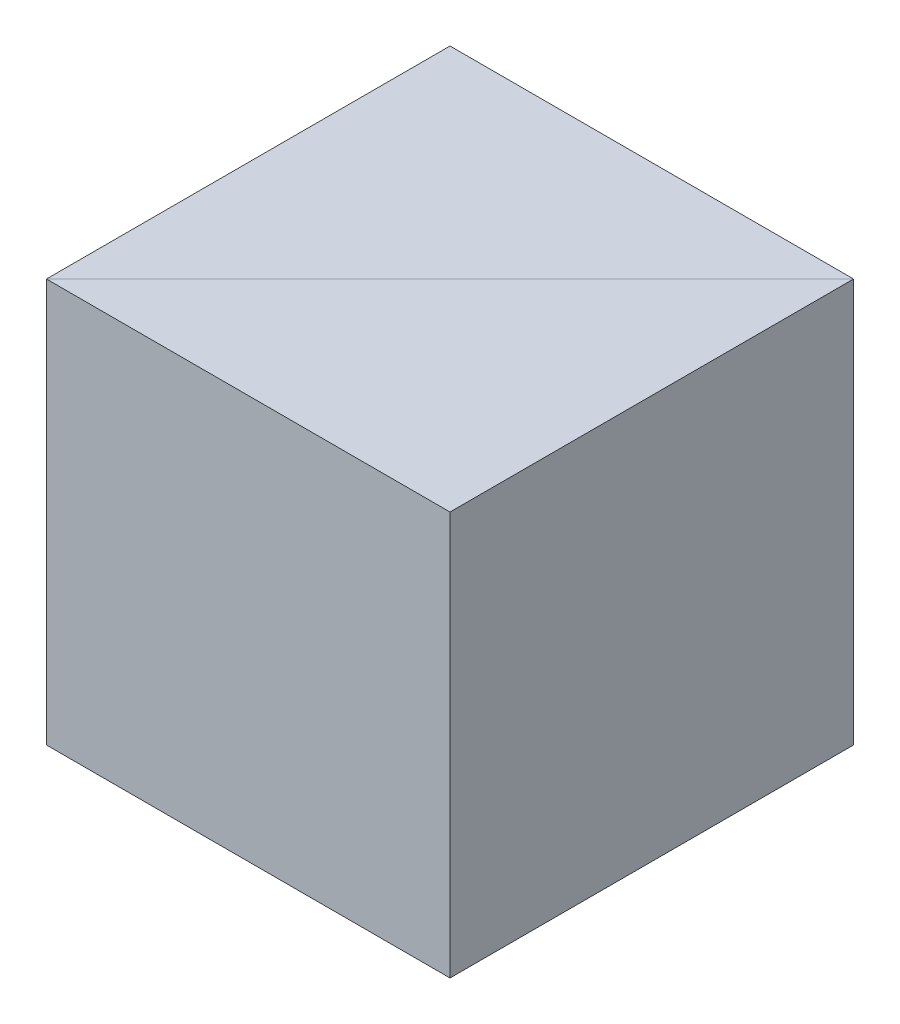
ISO-10303-21;
HEADER;
FILE_DESCRIPTION(('STEP AP214'),'2;1');
FILE_NAME('part.step','',(''),(''),'','','');
FILE_SCHEMA(('AUTOMOTIVE_DESIGN { 1 0 10303 214 1 1 1 1 }'));
ENDSEC;
DATA;
#1=APPLICATION_CONTEXT('core data for automotive mechanical design processes');
#2=APPLICATION_PROTOCOL_DEFINITION('international standard','automotive_design',2000,#1);
#3=PRODUCT_CONTEXT('',#1,'mechanical');
#4=PRODUCT('Part','Part','',(#3));
#5=PRODUCT_RELATED_PRODUCT_CATEGORY('part','',(#4));
#6=PRODUCT_DEFINITION_FORMATION('','',#4);
#7=PRODUCT_DEFINITION_CONTEXT('part definition',#1,'design');
#8=PRODUCT_DEFINITION('design','',#6,#7);
#9=PRODUCT_DEFINITION_SHAPE('','',#8);
#10=(LENGTH_UNIT() NAMED_UNIT(*) SI_UNIT(.MILLI.,.METRE.));
#11=(NAMED_UNIT(*) PLANE_ANGLE_UNIT() SI_UNIT($,.RADIAN.));
#12=(NAMED_UNIT(*) SI_UNIT($,.STERADIAN.) SOLID_ANGLE_UNIT());
#13=UNCERTAINTY_MEASURE_WITH_UNIT(LENGTH_MEASURE(1.E-05),#10,'distance_accuracy_value','');
#14=(GEOMETRIC_REPRESENTATION_CONTEXT(3) GLOBAL_UNCERTAINTY_ASSIGNED_CONTEXT((#13)) GLOBAL_UNIT_ASSIGNED_CONTEXT((#10,
#11,#12)) REPRESENTATION_CONTEXT('',''));
#15=CARTESIAN_POINT('',(0.,0.,0.));
#16=DIRECTION('',(0.,0.,1.));
#17=DIRECTION('',(1.,0.,0.));
#18=AXIS2_PLACEMENT_3D('',#15,#16,#17);
#19=CARTESIAN_POINT('',(-3.71974387893084,0.,-3.71974387893085));
#20=DIRECTION('',(0.,1.,0.));
#21=DIRECTION('',(1.,0.,0.));
#22=AXIS2_PLACEMENT_3D('',#19,#20,#21);
#23=PLANE('',#22);
#24=DIRECTION('',(0.,0.,1.));
#25=VECTOR('',#24,1.);
#26=CARTESIAN_POINT('',(-12.7,0.,-12.7));
#27=LINE('',#26,#25);
#28=CARTESIAN_POINT('',(-12.7,0.,-12.7));
#29=VERTEX_POINT('',#28);
#30=CARTESIAN_POINT('',(-12.7,0.,12.7));
#31=VERTEX_POINT('',#30);
#32=EDGE_CURVE('P0_E27',#29,#31,#27,.T.);
#33=ORIENTED_EDGE('',*,*,#32,.F.);
#34=DIRECTION('',(-1.,0.,0.));
#35=VECTOR('',#34,1.);
#36=CARTESIAN_POINT('',(12.7,0.,-12.7));
#37=LINE('',#36,#35);
#38=CARTESIAN_POINT('',(12.7,0.,-12.7));
#39=VERTEX_POINT('',#38);
#40=EDGE_CURVE('P0_E75',#39,#29,#37,.T.);
#41=ORIENTED_EDGE('',*,*,#40,.F.);
#42=DIRECTION('',(0.707106781186548,0.,-0.707106781186548));
#43=VECTOR('',#42,1.);
#44=CARTESIAN_POINT('',(-12.7,0.,12.7));
#45=LINE('',#44,#43);
#46=EDGE_CURVE('P0_E63',#31,#39,#45,.T.);
#47=ORIENTED_EDGE('',*,*,#46,.F.);
#48=EDGE_LOOP('',(#33,#41,#47));
#49=FACE_BOUND('',#48,.T.);
#50=ADVANCED_FACE('P0_F17',(#49),#23,.F.);
#51=CARTESIAN_POINT('',(-3.71974387893084,25.4,-3.71974387893085));
#52=DIRECTION('',(0.,1.,0.));
#53=DIRECTION('',(1.,0.,0.));
#54=AXIS2_PLACEMENT_3D('',#51,#52,#53);
#55=PLANE('',#54);
#56=DIRECTION('',(0.,0.,1.));
#57=VECTOR('',#56,1.);
#58=CARTESIAN_POINT('',(-12.7,25.4,-12.7));
#59=LINE('',#58,#57);
#60=CARTESIAN_POINT('',(-12.7,25.4,-12.7));
#61=VERTEX_POINT('',#60);
#62=CARTESIAN_POINT('',(-12.7,25.4,12.7));
#63=VERTEX_POINT('',#62);
#64=EDGE_CURVE('P0_E11',#61,#63,#59,.T.);
#65=ORIENTED_EDGE('',*,*,#64,.T.);
#66=DIRECTION('',(0.707106781186548,0.,-0.707106781186548));
#67=VECTOR('',#66,1.);
#68=CARTESIAN_POINT('',(-12.7,25.4,12.7));
#69=LINE('',#68,#67);
#70=CARTESIAN_POINT('',(12.7,25.4,-12.7));
#71=VERTEX_POINT('',#70);
#72=EDGE_CURVE('P0_E70',#63,#71,#69,.T.);
#73=ORIENTED_EDGE('',*,*,#72,.T.);
#74=DIRECTION('',(-1.,0.,0.));
#75=VECTOR('',#74,1.);
#76=CARTESIAN_POINT('',(12.7,25.4,-12.7));
#77=LINE('',#76,#75);
#78=EDGE_CURVE('P0_E76',#71,#61,#77,.T.);
#79=ORIENTED_EDGE('',*,*,#78,.T.);
#80=EDGE_LOOP('',(#65,#73,#79));
#81=FACE_BOUND('',#80,.T.);
#82=ADVANCED_FACE('P0_F100',(#81),#55,.T.);
#83=CARTESIAN_POINT('',(-12.7,0.,-12.7));
#84=DIRECTION('',(-1.,0.,0.));
#85=DIRECTION('',(0.,0.,1.));
#86=AXIS2_PLACEMENT_3D('',#83,#84,#85);
#87=PLANE('',#86);
#88=ORIENTED_EDGE('',*,*,#32,.T.);
#89=DIRECTION('',(0.,1.,0.));
#90=VECTOR('',#89,1.);
#91=CARTESIAN_POINT('',(-12.7,0.,12.7));
#92=LINE('',#91,#90);
#93=EDGE_CURVE('P0_E68',#31,#63,#92,.T.);
#94=ORIENTED_EDGE('',*,*,#93,.T.);
#95=ORIENTED_EDGE('',*,*,#64,.F.);
#96=DIRECTION('',(0.,1.,0.));
#97=VECTOR('',#96,1.);
#98=CARTESIAN_POINT('',(-12.7,0.,-12.7));
#99=LINE('',#98,#97);
#100=EDGE_CURVE('P0_E79',#29,#61,#99,.T.);
#101=ORIENTED_EDGE('',*,*,#100,.F.);
#102=EDGE_LOOP('',(#88,#94,#95,#101));
#103=FACE_BOUND('',#102,.T.);
#104=ADVANCED_FACE('P0_F102',(#103),#87,.T.);
#105=CARTESIAN_POINT('',(-12.7,0.,12.7));
#106=DIRECTION('',(0.707106781186548,0.,0.707106781186548));
#107=DIRECTION('',(0.,-1.,0.));
#108=AXIS2_PLACEMENT_3D('',#105,#106,#107);
#109=PLANE('',#108);
#110=ORIENTED_EDGE('',*,*,#46,.T.);
#111=DIRECTION('',(0.,1.,0.));
#112=VECTOR('',#111,1.);
#113=CARTESIAN_POINT('',(12.7,0.,-12.7));
#114=LINE('',#113,#112);
#115=EDGE_CURVE('P0_E20',#39,#71,#114,.T.);
#116=ORIENTED_EDGE('',*,*,#115,.T.);
#117=ORIENTED_EDGE('',*,*,#72,.F.);
#118=ORIENTED_EDGE('',*,*,#93,.F.);
#119=EDGE_LOOP('',(#110,#116,#117,#118));
#120=FACE_BOUND('',#119,.T.);
#121=ADVANCED_FACE('P0_F65',(#120),#109,.T.);
#122=CARTESIAN_POINT('',(12.7,0.,-12.7));
#123=DIRECTION('',(0.,0.,-1.));
#124=DIRECTION('',(0.,-1.,0.));
#125=AXIS2_PLACEMENT_3D('',#122,#123,#124);
#126=PLANE('',#125);
#127=ORIENTED_EDGE('',*,*,#40,.T.);
#128=ORIENTED_EDGE('',*,*,#100,.T.);
#129=ORIENTED_EDGE('',*,*,#78,.F.);
#130=ORIENTED_EDGE('',*,*,#115,.F.);
#131=EDGE_LOOP('',(#127,#128,#129,#130));
#132=FACE_BOUND('',#131,.T.);
#133=ADVANCED_FACE('P0_F73',(#132),#126,.T.);
#134=CLOSED_SHELL('',(#50,#82,#104,#121,#133));
#135=MANIFOLD_SOLID_BREP('P0_B1',#134);
#136=CARTESIAN_POINT('',(3.71974387893084,0.,3.71974387893085));
#137=DIRECTION('',(0.,1.,0.));
#138=DIRECTION('',(1.,0.,0.));
#139=AXIS2_PLACEMENT_3D('',#136,#137,#138);
#140=PLANE('',#139);
#141=DIRECTION('',(0.,0.,-1.));
#142=VECTOR('',#141,1.);
#143=CARTESIAN_POINT('',(12.7,0.,12.7));
#144=LINE('',#143,#142);
#145=CARTESIAN_POINT('',(12.7,0.,12.7));
#146=VERTEX_POINT('',#145);
#147=CARTESIAN_POINT('',(12.7,0.,-12.7));
#148=VERTEX_POINT('',#147);
#149=EDGE_CURVE('P1_E20',#146,#148,#144,.T.);
#150=ORIENTED_EDGE('',*,*,#149,.F.);
#151=DIRECTION('',(1.,0.,0.));
#152=VECTOR('',#151,1.);
#153=CARTESIAN_POINT('',(-12.7,0.,12.7));
#154=LINE('',#153,#152);
#155=CARTESIAN_POINT('',(-12.7,0.,12.7));
#156=VERTEX_POINT('',#155);
#157=EDGE_CURVE('P1_E77',#156,#146,#154,.T.);
#158=ORIENTED_EDGE('',*,*,#157,.F.);
#159=DIRECTION('',(-0.707106781186548,0.,0.707106781186548));
#160=VECTOR('',#159,1.);
#161=CARTESIAN_POINT('',(12.7,0.,-12.7));
#162=LINE('',#161,#160);
#163=EDGE_CURVE('P1_E62',#148,#156,#162,.T.);
#164=ORIENTED_EDGE('',*,*,#163,.F.);
#165=EDGE_LOOP('',(#150,#158,#164));
#166=FACE_BOUND('',#165,.T.);
#167=ADVANCED_FACE('P1_F16',(#166),#140,.F.);
#168=CARTESIAN_POINT('',(3.71974387893084,25.4,3.71974387893085));
#169=DIRECTION('',(0.,1.,0.));
#170=DIRECTION('',(1.,0.,0.));
#171=AXIS2_PLACEMENT_3D('',#168,#169,#170);
#172=PLANE('',#171);
#173=DIRECTION('',(0.,0.,-1.));
#174=VECTOR('',#173,1.);
#175=CARTESIAN_POINT('',(12.7,25.4,12.7));
#176=LINE('',#175,#174);
#177=CARTESIAN_POINT('',(12.7,25.4,12.7));
#178=VERTEX_POINT('',#177);
#179=CARTESIAN_POINT('',(12.7,25.4,-12.7));
#180=VERTEX_POINT('',#179);
#181=EDGE_CURVE('P1_E10',#178,#180,#176,.T.);
#182=ORIENTED_EDGE('',*,*,#181,.T.);
#183=DIRECTION('',(-0.707106781186548,0.,0.707106781186548));
#184=VECTOR('',#183,1.);
#185=CARTESIAN_POINT('',(12.7,25.4,-12.7));
#186=LINE('',#185,#184);
#187=CARTESIAN_POINT('',(-12.7,25.4,12.7));
#188=VERTEX_POINT('',#187);
#189=EDGE_CURVE('P1_E72',#180,#188,#186,.T.);
#190=ORIENTED_EDGE('',*,*,#189,.T.);
#191=DIRECTION('',(1.,0.,0.));
#192=VECTOR('',#191,1.);
#193=CARTESIAN_POINT('',(-12.7,25.4,12.7));
#194=LINE('',#193,#192);
#195=EDGE_CURVE('P1_E78',#188,#178,#194,.T.);
#196=ORIENTED_EDGE('',*,*,#195,.T.);
#197=EDGE_LOOP('',(#182,#190,#196));
#198=FACE_BOUND('',#197,.T.);
#199=ADVANCED_FACE('P1_F97',(#198),#172,.T.);
#200=CARTESIAN_POINT('',(12.7,0.,12.7));
#201=DIRECTION('',(1.,0.,0.));
#202=DIRECTION('',(0.,1.,0.));
#203=AXIS2_PLACEMENT_3D('',#200,#201,#202);
#204=PLANE('',#203);
#205=ORIENTED_EDGE('',*,*,#149,.T.);
#206=DIRECTION('',(0.,1.,0.));
#207=VECTOR('',#206,1.);
#208=CARTESIAN_POINT('',(12.7,0.,-12.7));
#209=LINE('',#208,#207);
#210=EDGE_CURVE('P1_E68',#148,#180,#209,.T.);
#211=ORIENTED_EDGE('',*,*,#210,.T.);
#212=ORIENTED_EDGE('',*,*,#181,.F.);
#213=DIRECTION('',(0.,1.,0.));
#214=VECTOR('',#213,1.);
#215=CARTESIAN_POINT('',(12.7,0.,12.7));
#216=LINE('',#215,#214);
#217=EDGE_CURVE('P1_E82',#146,#178,#216,.T.);
#218=ORIENTED_EDGE('',*,*,#217,.F.);
#219=EDGE_LOOP('',(#205,#211,#212,#218));
#220=FACE_BOUND('',#219,.T.);
#221=ADVANCED_FACE('P1_F100',(#220),#204,.T.);
#222=CARTESIAN_POINT('',(12.7,0.,-12.7));
#223=DIRECTION('',(-0.707106781186548,0.,-0.707106781186548));
#224=DIRECTION('',(-0.707106781186548,0.,0.707106781186548));
#225=AXIS2_PLACEMENT_3D('',#222,#223,#224);
#226=PLANE('',#225);
#227=ORIENTED_EDGE('',*,*,#163,.T.);
#228=DIRECTION('',(0.,1.,0.));
#229=VECTOR('',#228,1.);
#230=CARTESIAN_POINT('',(-12.7,0.,12.7));
#231=LINE('',#230,#229);
#232=EDGE_CURVE('P1_E66',#156,#188,#231,.T.);
#233=ORIENTED_EDGE('',*,*,#232,.T.);
#234=ORIENTED_EDGE('',*,*,#189,.F.);
#235=ORIENTED_EDGE('',*,*,#210,.F.);
#236=EDGE_LOOP('',(#227,#233,#234,#235));
#237=FACE_BOUND('',#236,.T.);
#238=ADVANCED_FACE('P1_F64',(#237),#226,.T.);
#239=CARTESIAN_POINT('',(-12.7,0.,12.7));
#240=DIRECTION('',(0.,0.,1.));
#241=DIRECTION('',(1.,0.,0.));
#242=AXIS2_PLACEMENT_3D('',#239,#240,#241);
#243=PLANE('',#242);
#244=ORIENTED_EDGE('',*,*,#157,.T.);
#245=ORIENTED_EDGE('',*,*,#217,.T.);
#246=ORIENTED_EDGE('',*,*,#195,.F.);
#247=ORIENTED_EDGE('',*,*,#232,.F.);
#248=EDGE_LOOP('',(#244,#245,#246,#247));
#249=FACE_BOUND('',#248,.T.);
#250=ADVANCED_FACE('P1_F18',(#249),#243,.T.);
#251=CLOSED_SHELL('',(#167,#199,#221,#238,#250));
#252=MANIFOLD_SOLID_BREP('P1_B1',#251);
#253=ADVANCED_BREP_SHAPE_REPRESENTATION('',(#18,#135,#252),#14);
#254=SHAPE_DEFINITION_REPRESENTATION(#9,#253);
ENDSEC;
END-ISO-10303-21;
